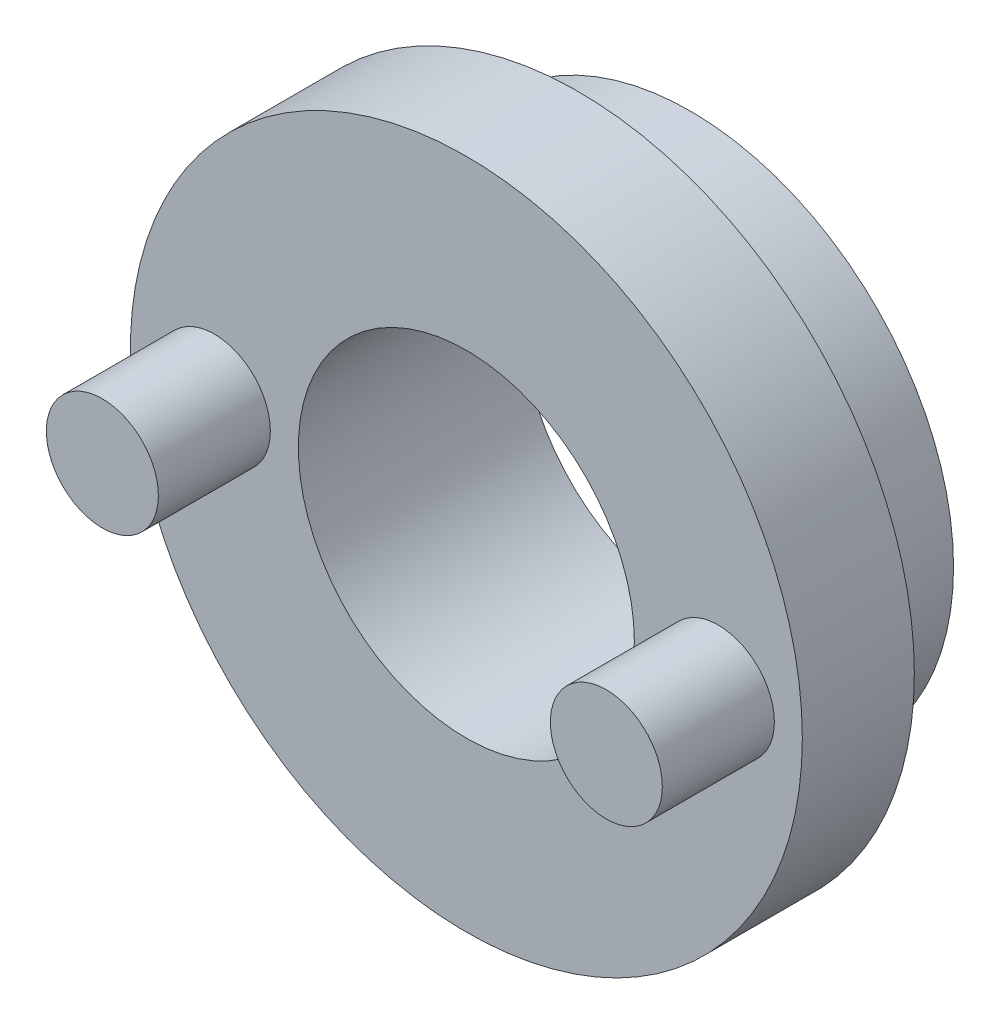
ISO-10303-21;
HEADER;
FILE_DESCRIPTION(('STEP AP214'),'2;1');
FILE_NAME('part.step','',(''),(''),'','','');
FILE_SCHEMA(('AUTOMOTIVE_DESIGN { 1 0 10303 214 1 1 1 1 }'));
ENDSEC;
DATA;
#1=APPLICATION_CONTEXT('core data for automotive mechanical design processes');
#2=APPLICATION_PROTOCOL_DEFINITION('international standard','automotive_design',2000,#1);
#3=PRODUCT_CONTEXT('',#1,'mechanical');
#4=PRODUCT('Part','Part','',(#3));
#5=PRODUCT_RELATED_PRODUCT_CATEGORY('part','',(#4));
#6=PRODUCT_DEFINITION_FORMATION('','',#4);
#7=PRODUCT_DEFINITION_CONTEXT('part definition',#1,'design');
#8=PRODUCT_DEFINITION('design','',#6,#7);
#9=PRODUCT_DEFINITION_SHAPE('','',#8);
#10=(LENGTH_UNIT() NAMED_UNIT(*) SI_UNIT(.MILLI.,.METRE.));
#11=(NAMED_UNIT(*) PLANE_ANGLE_UNIT() SI_UNIT($,.RADIAN.));
#12=(NAMED_UNIT(*) SI_UNIT($,.STERADIAN.) SOLID_ANGLE_UNIT());
#13=UNCERTAINTY_MEASURE_WITH_UNIT(LENGTH_MEASURE(1.E-05),#10,'distance_accuracy_value','');
#14=(GEOMETRIC_REPRESENTATION_CONTEXT(3) GLOBAL_UNCERTAINTY_ASSIGNED_CONTEXT((#13)) GLOBAL_UNIT_ASSIGNED_CONTEXT((#10,
#11,#12)) REPRESENTATION_CONTEXT('',''));
#15=CARTESIAN_POINT('',(0.,0.,0.));
#16=DIRECTION('',(0.,0.,1.));
#17=DIRECTION('',(1.,0.,0.));
#18=AXIS2_PLACEMENT_3D('',#15,#16,#17);
#19=CARTESIAN_POINT('',(0.,0.,-10.));
#20=DIRECTION('',(0.,0.,1.));
#21=DIRECTION('',(1.,0.,0.));
#22=AXIS2_PLACEMENT_3D('',#19,#20,#21);
#23=CYLINDRICAL_SURFACE('',#22,23.5);
#24=CARTESIAN_POINT('',(0.,0.,-2.99999999999999));
#25=DIRECTION('',(0.,0.,1.));
#26=DIRECTION('',(1.,0.,0.));
#27=AXIS2_PLACEMENT_3D('',#24,#25,#26);
#28=CIRCLE('',#27,23.5);
#29=CARTESIAN_POINT('',(23.5,0.,-2.99999999999999));
#30=VERTEX_POINT('',#29);
#31=EDGE_CURVE('E10',#30,#30,#28,.F.);
#32=ORIENTED_EDGE('',*,*,#31,.T.);
#33=EDGE_LOOP('',(#32));
#34=FACE_BOUND('',#33,.T.);
#35=CARTESIAN_POINT('',(0.,0.,-10.));
#36=DIRECTION('',(0.,0.,1.));
#37=DIRECTION('',(1.,0.,0.));
#38=AXIS2_PLACEMENT_3D('',#35,#36,#37);
#39=CIRCLE('',#38,23.5);
#40=CARTESIAN_POINT('',(23.5,0.,-10.));
#41=VERTEX_POINT('',#40);
#42=EDGE_CURVE('E59',#41,#41,#39,.T.);
#43=ORIENTED_EDGE('',*,*,#42,.T.);
#44=EDGE_LOOP('',(#43));
#45=FACE_BOUND('',#44,.T.);
#46=ADVANCED_FACE('F45',(#34,#45),#23,.T.);
#47=CARTESIAN_POINT('',(0.,0.,-10.));
#48=DIRECTION('',(0.,0.,1.));
#49=DIRECTION('',(1.,0.,0.));
#50=AXIS2_PLACEMENT_3D('',#47,#48,#49);
#51=PLANE('',#50);
#52=CARTESIAN_POINT('',(0.,0.,-10.));
#53=DIRECTION('',(0.,0.,1.));
#54=DIRECTION('',(1.,0.,0.));
#55=AXIS2_PLACEMENT_3D('',#52,#53,#54);
#56=CIRCLE('',#55,15.);
#57=CARTESIAN_POINT('',(15.,0.,-10.));
#58=VERTEX_POINT('',#57);
#59=EDGE_CURVE('E64',#58,#58,#56,.T.);
#60=ORIENTED_EDGE('',*,*,#59,.T.);
#61=EDGE_LOOP('',(#60));
#62=FACE_BOUND('',#61,.T.);
#63=ORIENTED_EDGE('',*,*,#42,.F.);
#64=EDGE_LOOP('',(#63));
#65=FACE_BOUND('',#64,.T.);
#66=ADVANCED_FACE('F114',(#62,#65),#51,.F.);
#67=CARTESIAN_POINT('',(0.,0.,-10.));
#68=DIRECTION('',(0.,0.,1.));
#69=DIRECTION('',(1.,0.,0.));
#70=AXIS2_PLACEMENT_3D('',#67,#68,#69);
#71=CYLINDRICAL_SURFACE('',#70,15.);
#72=ORIENTED_EDGE('',*,*,#59,.F.);
#73=EDGE_LOOP('',(#72));
#74=FACE_BOUND('',#73,.T.);
#75=CARTESIAN_POINT('',(0.,0.,10.));
#76=DIRECTION('',(0.,0.,1.));
#77=DIRECTION('',(1.,0.,0.));
#78=AXIS2_PLACEMENT_3D('',#75,#76,#77);
#79=CIRCLE('',#78,15.);
#80=CARTESIAN_POINT('',(15.,0.,10.));
#81=VERTEX_POINT('',#80);
#82=EDGE_CURVE('E75',#81,#81,#79,.T.);
#83=ORIENTED_EDGE('',*,*,#82,.T.);
#84=EDGE_LOOP('',(#83));
#85=FACE_BOUND('',#84,.T.);
#86=ADVANCED_FACE('F105',(#74,#85),#71,.F.);
#87=CARTESIAN_POINT('',(0.,0.,10.));
#88=DIRECTION('',(0.,0.,1.));
#89=DIRECTION('',(1.,0.,0.));
#90=AXIS2_PLACEMENT_3D('',#87,#88,#89);
#91=PLANE('',#90);
#92=CARTESIAN_POINT('',(22.5,0.,10.));
#93=DIRECTION('',(0.,0.,1.));
#94=DIRECTION('',(1.,0.,0.));
#95=AXIS2_PLACEMENT_3D('',#92,#93,#94);
#96=CIRCLE('',#95,5.);
#97=CARTESIAN_POINT('',(27.5,0.,10.));
#98=VERTEX_POINT('',#97);
#99=EDGE_CURVE('E87',#98,#98,#96,.T.);
#100=ORIENTED_EDGE('',*,*,#99,.F.);
#101=EDGE_LOOP('',(#100));
#102=FACE_BOUND('',#101,.T.);
#103=CARTESIAN_POINT('',(-22.5,0.,10.));
#104=DIRECTION('',(0.,0.,1.));
#105=DIRECTION('',(1.,0.,0.));
#106=AXIS2_PLACEMENT_3D('',#103,#104,#105);
#107=CIRCLE('',#106,5.);
#108=CARTESIAN_POINT('',(-17.5,0.,10.));
#109=VERTEX_POINT('',#108);
#110=EDGE_CURVE('E83',#109,#109,#107,.T.);
#111=ORIENTED_EDGE('',*,*,#110,.F.);
#112=EDGE_LOOP('',(#111));
#113=FACE_BOUND('',#112,.T.);
#114=CARTESIAN_POINT('',(0.,0.,10.));
#115=DIRECTION('',(0.,0.,1.));
#116=DIRECTION('',(1.,0.,0.));
#117=AXIS2_PLACEMENT_3D('',#114,#115,#116);
#118=CIRCLE('',#117,30.);
#119=CARTESIAN_POINT('',(30.,0.,10.));
#120=VERTEX_POINT('',#119);
#121=EDGE_CURVE('E70',#120,#120,#118,.T.);
#122=ORIENTED_EDGE('',*,*,#121,.T.);
#123=EDGE_LOOP('',(#122));
#124=FACE_BOUND('',#123,.T.);
#125=ORIENTED_EDGE('',*,*,#82,.F.);
#126=EDGE_LOOP('',(#125));
#127=FACE_BOUND('',#126,.T.);
#128=ADVANCED_FACE('F101',(#102,#113,#124,#127),#91,.T.);
#129=CARTESIAN_POINT('',(0.,0.,0.));
#130=DIRECTION('',(0.,0.,1.));
#131=DIRECTION('',(1.,0.,0.));
#132=AXIS2_PLACEMENT_3D('',#129,#130,#131);
#133=PLANE('',#132);
#134=CARTESIAN_POINT('',(0.,0.,0.));
#135=DIRECTION('',(0.,0.,1.));
#136=DIRECTION('',(1.,0.,0.));
#137=AXIS2_PLACEMENT_3D('',#134,#135,#136);
#138=CIRCLE('',#137,26.5);
#139=CARTESIAN_POINT('',(26.5,0.,0.));
#140=VERTEX_POINT('',#139);
#141=EDGE_CURVE('E54',#140,#140,#138,.T.);
#142=ORIENTED_EDGE('',*,*,#141,.T.);
#143=EDGE_LOOP('',(#142));
#144=FACE_BOUND('',#143,.T.);
#145=CARTESIAN_POINT('',(0.,0.,0.));
#146=DIRECTION('',(0.,0.,1.));
#147=DIRECTION('',(1.,0.,0.));
#148=AXIS2_PLACEMENT_3D('',#145,#146,#147);
#149=CIRCLE('',#148,30.);
#150=CARTESIAN_POINT('',(30.,0.,0.));
#151=VERTEX_POINT('',#150);
#152=EDGE_CURVE('E71',#151,#151,#149,.T.);
#153=ORIENTED_EDGE('',*,*,#152,.F.);
#154=EDGE_LOOP('',(#153));
#155=FACE_BOUND('',#154,.T.);
#156=ADVANCED_FACE('F104',(#144,#155),#133,.F.);
#157=CARTESIAN_POINT('',(0.,0.,10.));
#158=DIRECTION('',(0.,0.,-1.));
#159=DIRECTION('',(-1.,0.,0.));
#160=AXIS2_PLACEMENT_3D('',#157,#158,#159);
#161=CYLINDRICAL_SURFACE('',#160,30.);
#162=ORIENTED_EDGE('',*,*,#121,.F.);
#163=EDGE_LOOP('',(#162));
#164=FACE_BOUND('',#163,.T.);
#165=ORIENTED_EDGE('',*,*,#152,.T.);
#166=EDGE_LOOP('',(#165));
#167=FACE_BOUND('',#166,.T.);
#168=ADVANCED_FACE('F136',(#164,#167),#161,.T.);
#169=CARTESIAN_POINT('',(0.,0.,0.));
#170=DIRECTION('',(0.,0.,1.));
#171=DIRECTION('',(1.,0.,0.));
#172=AXIS2_PLACEMENT_3D('',#169,#170,#171);
#173=CONICAL_SURFACE('',#172,26.5,0.785398163397452);
#174=ORIENTED_EDGE('',*,*,#31,.F.);
#175=EDGE_LOOP('',(#174));
#176=FACE_BOUND('',#175,.T.);
#177=ORIENTED_EDGE('',*,*,#141,.F.);
#178=EDGE_LOOP('',(#177));
#179=FACE_BOUND('',#178,.T.);
#180=ADVANCED_FACE('F48',(#176,#179),#173,.T.);
#181=CARTESIAN_POINT('',(-22.5,0.,20.));
#182=DIRECTION('',(0.,0.,-1.));
#183=DIRECTION('',(-1.,0.,0.));
#184=AXIS2_PLACEMENT_3D('',#181,#182,#183);
#185=CYLINDRICAL_SURFACE('',#184,5.);
#186=CARTESIAN_POINT('',(-22.5,0.,20.));
#187=DIRECTION('',(0.,0.,1.));
#188=DIRECTION('',(1.,0.,0.));
#189=AXIS2_PLACEMENT_3D('',#186,#187,#188);
#190=CIRCLE('',#189,5.);
#191=CARTESIAN_POINT('',(-17.5,0.,20.));
#192=VERTEX_POINT('',#191);
#193=EDGE_CURVE('E82',#192,#192,#190,.T.);
#194=ORIENTED_EDGE('',*,*,#193,.F.);
#195=EDGE_LOOP('',(#194));
#196=FACE_BOUND('',#195,.T.);
#197=ORIENTED_EDGE('',*,*,#110,.T.);
#198=EDGE_LOOP('',(#197));
#199=FACE_BOUND('',#198,.T.);
#200=ADVANCED_FACE('F149',(#196,#199),#185,.T.);
#201=CARTESIAN_POINT('',(-22.5,0.,20.));
#202=DIRECTION('',(0.,0.,1.));
#203=DIRECTION('',(1.,0.,0.));
#204=AXIS2_PLACEMENT_3D('',#201,#202,#203);
#205=PLANE('',#204);
#206=ORIENTED_EDGE('',*,*,#193,.T.);
#207=EDGE_LOOP('',(#206));
#208=FACE_BOUND('',#207,.T.);
#209=ADVANCED_FACE('F162',(#208),#205,.T.);
#210=CARTESIAN_POINT('',(22.5,0.,20.));
#211=DIRECTION('',(0.,0.,-1.));
#212=DIRECTION('',(-1.,0.,0.));
#213=AXIS2_PLACEMENT_3D('',#210,#211,#212);
#214=CYLINDRICAL_SURFACE('',#213,5.);
#215=CARTESIAN_POINT('',(22.5,0.,20.));
#216=DIRECTION('',(0.,0.,1.));
#217=DIRECTION('',(1.,0.,0.));
#218=AXIS2_PLACEMENT_3D('',#215,#216,#217);
#219=CIRCLE('',#218,5.);
#220=CARTESIAN_POINT('',(27.5,0.,20.));
#221=VERTEX_POINT('',#220);
#222=EDGE_CURVE('E91',#221,#221,#219,.T.);
#223=ORIENTED_EDGE('',*,*,#222,.F.);
#224=EDGE_LOOP('',(#223));
#225=FACE_BOUND('',#224,.T.);
#226=ORIENTED_EDGE('',*,*,#99,.T.);
#227=EDGE_LOOP('',(#226));
#228=FACE_BOUND('',#227,.T.);
#229=ADVANCED_FACE('F99',(#225,#228),#214,.T.);
#230=CARTESIAN_POINT('',(22.5,0.,20.));
#231=DIRECTION('',(0.,0.,1.));
#232=DIRECTION('',(1.,0.,0.));
#233=AXIS2_PLACEMENT_3D('',#230,#231,#232);
#234=PLANE('',#233);
#235=ORIENTED_EDGE('',*,*,#222,.T.);
#236=EDGE_LOOP('',(#235));
#237=FACE_BOUND('',#236,.T.);
#238=ADVANCED_FACE('F179',(#237),#234,.T.);
#239=CLOSED_SHELL('',(#46,#66,#86,#128,#156,#168,#180,#200,#209,#229,#238));
#240=MANIFOLD_SOLID_BREP('B2',#239);
#241=ADVANCED_BREP_SHAPE_REPRESENTATION('',(#18,#240),#14);
#242=SHAPE_DEFINITION_REPRESENTATION(#9,#241);
ENDSEC;
END-ISO-10303-21;
